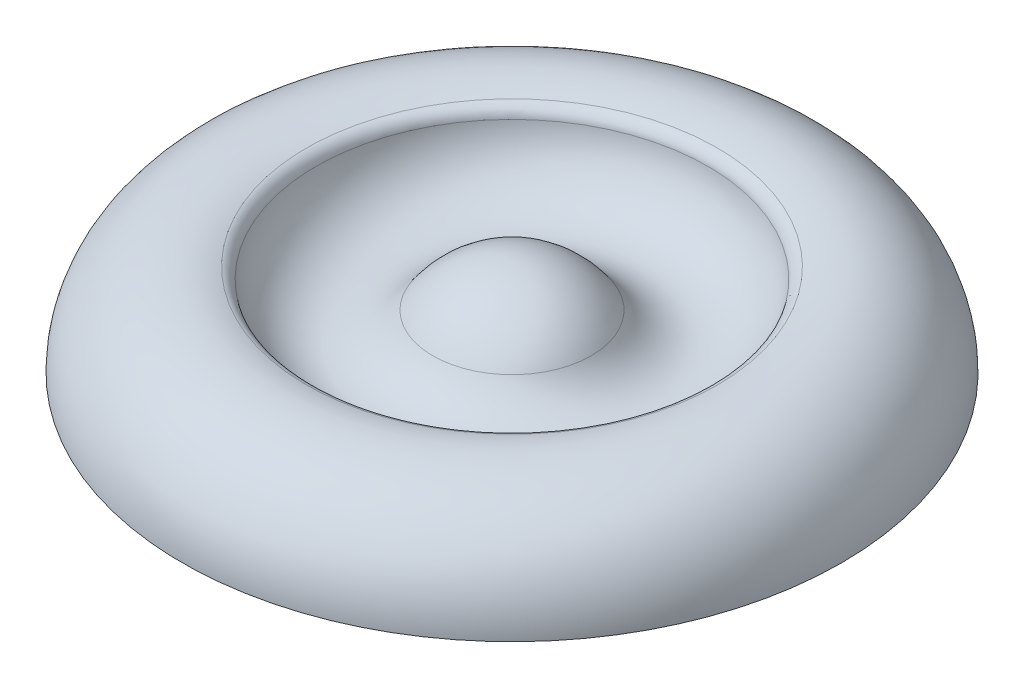
ISO-10303-21;
HEADER;
FILE_DESCRIPTION(('STEP AP214'),'2;1');
FILE_NAME('part.step','',(''),(''),'','','');
FILE_SCHEMA(('AUTOMOTIVE_DESIGN { 1 0 10303 214 1 1 1 1 }'));
ENDSEC;
DATA;
#1=APPLICATION_CONTEXT('core data for automotive mechanical design processes');
#2=APPLICATION_PROTOCOL_DEFINITION('international standard','automotive_design',2000,#1);
#3=PRODUCT_CONTEXT('',#1,'mechanical');
#4=PRODUCT('Part','Part','',(#3));
#5=PRODUCT_RELATED_PRODUCT_CATEGORY('part','',(#4));
#6=PRODUCT_DEFINITION_FORMATION('','',#4);
#7=PRODUCT_DEFINITION_CONTEXT('part definition',#1,'design');
#8=PRODUCT_DEFINITION('design','',#6,#7);
#9=PRODUCT_DEFINITION_SHAPE('','',#8);
#10=(LENGTH_UNIT() NAMED_UNIT(*) SI_UNIT(.MILLI.,.METRE.));
#11=(NAMED_UNIT(*) PLANE_ANGLE_UNIT() SI_UNIT($,.RADIAN.));
#12=(NAMED_UNIT(*) SI_UNIT($,.STERADIAN.) SOLID_ANGLE_UNIT());
#13=UNCERTAINTY_MEASURE_WITH_UNIT(LENGTH_MEASURE(1.E-05),#10,'distance_accuracy_value','');
#14=(GEOMETRIC_REPRESENTATION_CONTEXT(3) GLOBAL_UNCERTAINTY_ASSIGNED_CONTEXT((#13)) GLOBAL_UNIT_ASSIGNED_CONTEXT((#10,
#11,#12)) REPRESENTATION_CONTEXT('',''));
#15=CARTESIAN_POINT('',(0.,0.,0.));
#16=DIRECTION('',(0.,0.,1.));
#17=DIRECTION('',(1.,0.,0.));
#18=AXIS2_PLACEMENT_3D('',#15,#16,#17);
#19=CARTESIAN_POINT('',(0.,-1.33025516058267E-13,0.));
#20=DIRECTION('',(0.,-1.,0.));
#21=DIRECTION('',(1.,0.,0.));
#22=AXIS2_PLACEMENT_3D('',#19,#20,#21);
#23=PLANE('',#22);
#24=CARTESIAN_POINT('',(0.,-2.66051032116535E-13,0.));
#25=DIRECTION('',(0.,-1.,0.));
#26=DIRECTION('',(1.,0.,0.));
#27=AXIS2_PLACEMENT_3D('',#24,#25,#26);
#28=CIRCLE('',#27,76.2);
#29=CARTESIAN_POINT('',(76.2,0.,0.));
#30=VERTEX_POINT('',#29);
#31=EDGE_CURVE('E10',#30,#30,#28,.T.);
#32=ORIENTED_EDGE('',*,*,#31,.T.);
#33=EDGE_LOOP('',(#32));
#34=FACE_BOUND('',#33,.T.);
#35=ADVANCED_FACE('F30',(#34),#23,.T.);
#36=CARTESIAN_POINT('',(0.,-1.88452814415879E-13,0.));
#37=DIRECTION('',(0.,-1.,0.));
#38=DIRECTION('',(1.,0.,0.));
#39=AXIS2_PLACEMENT_3D('',#36,#37,#38);
#40=TOROIDAL_SURFACE('',#39,53.975,22.225);
#41=CARTESIAN_POINT('',(0.,21.2572744873688,0.));
#42=DIRECTION('',(0.,-1.,0.));
#43=DIRECTION('',(1.,0.,0.));
#44=AXIS2_PLACEMENT_3D('',#41,#42,#43);
#45=CIRCLE('',#44,47.4881743997043);
#46=CARTESIAN_POINT('',(47.4881743997042,21.2572744873689,0.));
#47=VERTEX_POINT('',#46);
#48=EDGE_CURVE('E36',#47,#47,#45,.T.);
#49=ORIENTED_EDGE('',*,*,#48,.T.);
#50=EDGE_LOOP('',(#49));
#51=FACE_BOUND('',#50,.T.);
#52=ORIENTED_EDGE('',*,*,#31,.F.);
#53=EDGE_LOOP('',(#52));
#54=FACE_BOUND('',#53,.T.);
#55=ADVANCED_FACE('F62',(#51,#54),#40,.T.);
#56=CARTESIAN_POINT('',(0.,18.2205209891732,0.));
#57=DIRECTION('',(0.,-1.,0.));
#58=DIRECTION('',(1.,0.,0.));
#59=AXIS2_PLACEMENT_3D('',#56,#57,#58);
#60=TOROIDAL_SURFACE('',#59,48.4148637711751,3.175);
#61=CARTESIAN_POINT('',(0.,18.6970415625983,0.));
#62=DIRECTION('',(0.,-1.,0.));
#63=DIRECTION('',(1.,0.,0.));
#64=AXIS2_PLACEMENT_3D('',#61,#62,#63);
#65=CIRCLE('',#64,45.2758267941545);
#66=CARTESIAN_POINT('',(45.2758267941544,18.6970415625985,0.));
#67=VERTEX_POINT('',#66);
#68=EDGE_CURVE('E40',#67,#67,#65,.T.);
#69=ORIENTED_EDGE('',*,*,#68,.T.);
#70=EDGE_LOOP('',(#69));
#71=FACE_BOUND('',#70,.T.);
#72=ORIENTED_EDGE('',*,*,#48,.F.);
#73=EDGE_LOOP('',(#72));
#74=FACE_BOUND('',#73,.T.);
#75=ADVANCED_FACE('F59',(#71,#74),#60,.T.);
#76=CARTESIAN_POINT('',(0.,20.9268959832053,0.));
#77=DIRECTION('',(0.,-1.,0.));
#78=DIRECTION('',(1.,0.,0.));
#79=AXIS2_PLACEMENT_3D('',#76,#77,#78);
#80=TOROIDAL_SURFACE('',#79,30.5868587411141,14.8572552377733);
#81=CARTESIAN_POINT('',(0.,12.537503621623,0.));
#82=DIRECTION('',(0.,-1.,0.));
#83=DIRECTION('',(1.,0.,0.));
#84=AXIS2_PLACEMENT_3D('',#81,#82,#83);
#85=CIRCLE('',#84,18.3248797408154);
#86=CARTESIAN_POINT('',(18.3248797408154,12.5375036216231,0.));
#87=VERTEX_POINT('',#86);
#88=EDGE_CURVE('E44',#87,#87,#85,.T.);
#89=ORIENTED_EDGE('',*,*,#88,.T.);
#90=EDGE_LOOP('',(#89));
#91=FACE_BOUND('',#90,.T.);
#92=ORIENTED_EDGE('',*,*,#68,.F.);
#93=EDGE_LOOP('',(#92));
#94=FACE_BOUND('',#93,.T.);
#95=ADVANCED_FACE('F50',(#91,#94),#80,.F.);
#96=CARTESIAN_POINT('',(0.,0.,0.));
#97=DIRECTION('',(0.,-1.,0.));
#98=DIRECTION('',(1.,0.,0.));
#99=AXIS2_PLACEMENT_3D('',#96,#97,#98);
#100=SPHERICAL_SURFACE('',#99,22.2033829534501);
#101=ORIENTED_EDGE('',*,*,#88,.F.);
#102=EDGE_LOOP('',(#101));
#103=FACE_BOUND('',#102,.T.);
#104=ADVANCED_FACE('F53',(#103),#100,.T.);
#105=CLOSED_SHELL('',(#35,#55,#75,#95,#104));
#106=MANIFOLD_SOLID_BREP('B2',#105);
#107=ADVANCED_BREP_SHAPE_REPRESENTATION('',(#18,#106),#14);
#108=SHAPE_DEFINITION_REPRESENTATION(#9,#107);
ENDSEC;
END-ISO-10303-21;
